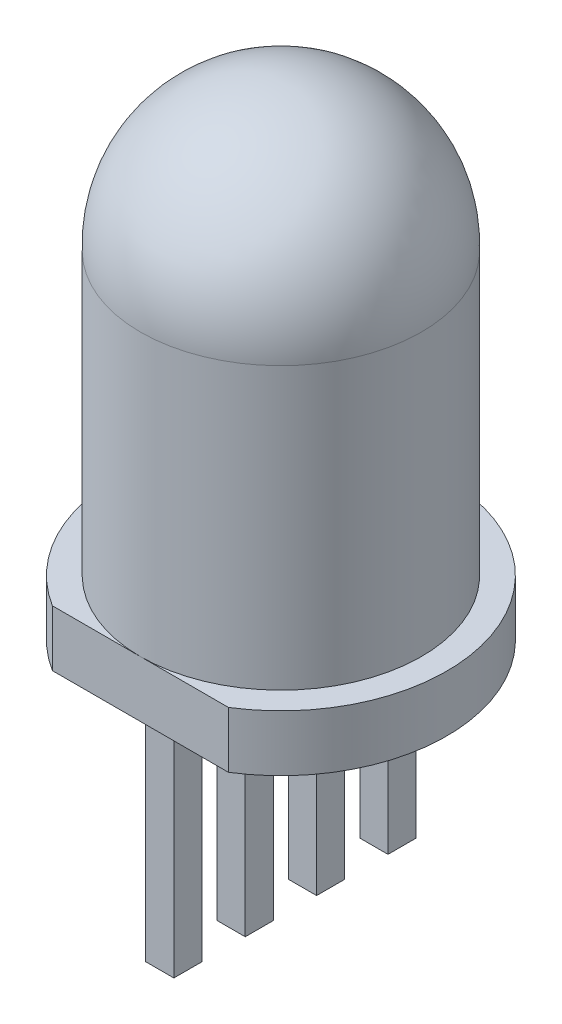
ISO-10303-21;
HEADER;
FILE_DESCRIPTION(('STEP AP214'),'2;1');
FILE_NAME('part.step','',(''),(''),'','','');
FILE_SCHEMA(('AUTOMOTIVE_DESIGN { 1 0 10303 214 1 1 1 1 }'));
ENDSEC;
DATA;
#1=APPLICATION_CONTEXT('core data for automotive mechanical design processes');
#2=APPLICATION_PROTOCOL_DEFINITION('international standard','automotive_design',2000,#1);
#3=PRODUCT_CONTEXT('',#1,'mechanical');
#4=PRODUCT('Part','Part','',(#3));
#5=PRODUCT_RELATED_PRODUCT_CATEGORY('part','',(#4));
#6=PRODUCT_DEFINITION_FORMATION('','',#4);
#7=PRODUCT_DEFINITION_CONTEXT('part definition',#1,'design');
#8=PRODUCT_DEFINITION('design','',#6,#7);
#9=PRODUCT_DEFINITION_SHAPE('','',#8);
#10=(LENGTH_UNIT() NAMED_UNIT(*) SI_UNIT(.MILLI.,.METRE.));
#11=(NAMED_UNIT(*) PLANE_ANGLE_UNIT() SI_UNIT($,.RADIAN.));
#12=(NAMED_UNIT(*) SI_UNIT($,.STERADIAN.) SOLID_ANGLE_UNIT());
#13=UNCERTAINTY_MEASURE_WITH_UNIT(LENGTH_MEASURE(1.E-05),#10,'distance_accuracy_value','');
#14=(GEOMETRIC_REPRESENTATION_CONTEXT(3) GLOBAL_UNCERTAINTY_ASSIGNED_CONTEXT((#13)) GLOBAL_UNIT_ASSIGNED_CONTEXT((#10,
#11,#12)) REPRESENTATION_CONTEXT('',''));
#15=CARTESIAN_POINT('',(0.,0.,0.));
#16=DIRECTION('',(0.,0.,1.));
#17=DIRECTION('',(1.,0.,0.));
#18=AXIS2_PLACEMENT_3D('',#15,#16,#17);
#19=CARTESIAN_POINT('',(0.,0.,0.));
#20=DIRECTION('',(0.,1.,0.));
#21=DIRECTION('',(0.,0.,1.));
#22=AXIS2_PLACEMENT_3D('',#19,#20,#21);
#23=PLANE('',#22);
#24=DIRECTION('',(0.,0.,1.));
#25=VECTOR('',#24,1.);
#26=CARTESIAN_POINT('',(0.25,0.,-0.385));
#27=LINE('',#26,#25);
#28=CARTESIAN_POINT('',(0.25,0.,-0.885));
#29=VERTEX_POINT('',#28);
#30=CARTESIAN_POINT('',(0.25,0.,-0.385));
#31=VERTEX_POINT('',#30);
#32=EDGE_CURVE('E182',#29,#31,#27,.T.);
#33=ORIENTED_EDGE('',*,*,#32,.F.);
#34=DIRECTION('',(1.,0.,0.));
#35=VECTOR('',#34,1.);
#36=CARTESIAN_POINT('',(0.25,0.,-0.885));
#37=LINE('',#36,#35);
#38=CARTESIAN_POINT('',(-0.25,0.,-0.885));
#39=VERTEX_POINT('',#38);
#40=EDGE_CURVE('E195',#39,#29,#37,.T.);
#41=ORIENTED_EDGE('',*,*,#40,.F.);
#42=DIRECTION('',(0.,0.,-1.));
#43=VECTOR('',#42,1.);
#44=CARTESIAN_POINT('',(-0.25,0.,-0.385));
#45=LINE('',#44,#43);
#46=CARTESIAN_POINT('',(-0.25,0.,-0.385));
#47=VERTEX_POINT('',#46);
#48=EDGE_CURVE('E204',#47,#39,#45,.T.);
#49=ORIENTED_EDGE('',*,*,#48,.F.);
#50=DIRECTION('',(-1.,0.,0.));
#51=VECTOR('',#50,1.);
#52=CARTESIAN_POINT('',(0.25,0.,-0.385));
#53=LINE('',#52,#51);
#54=EDGE_CURVE('E185',#31,#47,#53,.T.);
#55=ORIENTED_EDGE('',*,*,#54,.F.);
#56=EDGE_LOOP('',(#33,#41,#49,#55));
#57=FACE_BOUND('',#56,.T.);
#58=DIRECTION('',(0.,0.,1.));
#59=VECTOR('',#58,1.);
#60=CARTESIAN_POINT('',(0.25,0.,2.155));
#61=LINE('',#60,#59);
#62=CARTESIAN_POINT('',(0.25,0.,1.655));
#63=VERTEX_POINT('',#62);
#64=CARTESIAN_POINT('',(0.25,0.,2.155));
#65=VERTEX_POINT('',#64);
#66=EDGE_CURVE('E253',#63,#65,#61,.T.);
#67=ORIENTED_EDGE('',*,*,#66,.F.);
#68=DIRECTION('',(1.,0.,0.));
#69=VECTOR('',#68,1.);
#70=CARTESIAN_POINT('',(0.25,0.,1.655));
#71=LINE('',#70,#69);
#72=CARTESIAN_POINT('',(-0.25,0.,1.655));
#73=VERTEX_POINT('',#72);
#74=EDGE_CURVE('E258',#73,#63,#71,.T.);
#75=ORIENTED_EDGE('',*,*,#74,.F.);
#76=DIRECTION('',(0.,0.,-1.));
#77=VECTOR('',#76,1.);
#78=CARTESIAN_POINT('',(-0.25,0.,2.155));
#79=LINE('',#78,#77);
#80=CARTESIAN_POINT('',(-0.25,0.,2.155));
#81=VERTEX_POINT('',#80);
#82=EDGE_CURVE('E270',#81,#73,#79,.T.);
#83=ORIENTED_EDGE('',*,*,#82,.F.);
#84=DIRECTION('',(-1.,0.,0.));
#85=VECTOR('',#84,1.);
#86=CARTESIAN_POINT('',(0.25,0.,2.155));
#87=LINE('',#86,#85);
#88=EDGE_CURVE('E267',#65,#81,#87,.T.);
#89=ORIENTED_EDGE('',*,*,#88,.F.);
#90=EDGE_LOOP('',(#67,#75,#83,#89));
#91=FACE_BOUND('',#90,.T.);
#92=CARTESIAN_POINT('',(0.,0.,0.));
#93=DIRECTION('',(0.,1.,0.));
#94=DIRECTION('',(0.,0.,1.));
#95=AXIS2_PLACEMENT_3D('',#92,#93,#94);
#96=CIRCLE('',#95,2.95);
#97=CARTESIAN_POINT('',(1.56604597633659,0.,2.5));
#98=VERTEX_POINT('',#97);
#99=CARTESIAN_POINT('',(-1.56604597633659,0.,2.5));
#100=VERTEX_POINT('',#99);
#101=EDGE_CURVE('E296',#98,#100,#96,.T.);
#102=ORIENTED_EDGE('',*,*,#101,.F.);
#103=DIRECTION('',(1.,0.,0.));
#104=VECTOR('',#103,1.);
#105=CARTESIAN_POINT('',(-2.16489651360648,0.,2.5));
#106=LINE('',#105,#104);
#107=EDGE_CURVE('E290',#100,#98,#106,.T.);
#108=ORIENTED_EDGE('',*,*,#107,.F.);
#109=EDGE_LOOP('',(#102,#108));
#110=FACE_BOUND('',#109,.T.);
#111=DIRECTION('',(0.,0.,1.));
#112=VECTOR('',#111,1.);
#113=CARTESIAN_POINT('',(0.25,0.,0.885));
#114=LINE('',#113,#112);
#115=CARTESIAN_POINT('',(0.25,0.,0.385));
#116=VERTEX_POINT('',#115);
#117=CARTESIAN_POINT('',(0.25,0.,0.885));
#118=VERTEX_POINT('',#117);
#119=EDGE_CURVE('E220',#116,#118,#114,.T.);
#120=ORIENTED_EDGE('',*,*,#119,.F.);
#121=DIRECTION('',(1.,0.,0.));
#122=VECTOR('',#121,1.);
#123=CARTESIAN_POINT('',(0.25,0.,0.385));
#124=LINE('',#123,#122);
#125=CARTESIAN_POINT('',(-0.25,0.,0.385));
#126=VERTEX_POINT('',#125);
#127=EDGE_CURVE('E225',#126,#116,#124,.T.);
#128=ORIENTED_EDGE('',*,*,#127,.F.);
#129=DIRECTION('',(0.,0.,-1.));
#130=VECTOR('',#129,1.);
#131=CARTESIAN_POINT('',(-0.25,0.,0.885));
#132=LINE('',#131,#130);
#133=CARTESIAN_POINT('',(-0.25,0.,0.885));
#134=VERTEX_POINT('',#133);
#135=EDGE_CURVE('E237',#134,#126,#132,.T.);
#136=ORIENTED_EDGE('',*,*,#135,.F.);
#137=DIRECTION('',(-1.,0.,0.));
#138=VECTOR('',#137,1.);
#139=CARTESIAN_POINT('',(0.25,0.,0.885));
#140=LINE('',#139,#138);
#141=EDGE_CURVE('E234',#118,#134,#140,.T.);
#142=ORIENTED_EDGE('',*,*,#141,.F.);
#143=EDGE_LOOP('',(#120,#128,#136,#142));
#144=FACE_BOUND('',#143,.T.);
#145=DIRECTION('',(0.,0.,1.));
#146=VECTOR('',#145,1.);
#147=CARTESIAN_POINT('',(0.25,0.,-1.655));
#148=LINE('',#147,#146);
#149=CARTESIAN_POINT('',(0.25,0.,-2.155));
#150=VERTEX_POINT('',#149);
#151=CARTESIAN_POINT('',(0.25,0.,-1.655));
#152=VERTEX_POINT('',#151);
#153=EDGE_CURVE('E181',#150,#152,#148,.T.);
#154=ORIENTED_EDGE('',*,*,#153,.F.);
#155=DIRECTION('',(1.,0.,0.));
#156=VECTOR('',#155,1.);
#157=CARTESIAN_POINT('',(0.25,0.,-2.155));
#158=LINE('',#157,#156);
#159=CARTESIAN_POINT('',(-0.25,0.,-2.155));
#160=VERTEX_POINT('',#159);
#161=EDGE_CURVE('E178',#160,#150,#158,.T.);
#162=ORIENTED_EDGE('',*,*,#161,.F.);
#163=DIRECTION('',(0.,0.,-1.));
#164=VECTOR('',#163,1.);
#165=CARTESIAN_POINT('',(-0.25,0.,-1.655));
#166=LINE('',#165,#164);
#167=CARTESIAN_POINT('',(-0.25,0.,-1.655));
#168=VERTEX_POINT('',#167);
#169=EDGE_CURVE('E53',#168,#160,#166,.T.);
#170=ORIENTED_EDGE('',*,*,#169,.F.);
#171=DIRECTION('',(-1.,0.,0.));
#172=VECTOR('',#171,1.);
#173=CARTESIAN_POINT('',(0.25,0.,-1.655));
#174=LINE('',#173,#172);
#175=EDGE_CURVE('E48',#152,#168,#174,.T.);
#176=ORIENTED_EDGE('',*,*,#175,.F.);
#177=EDGE_LOOP('',(#154,#162,#170,#176));
#178=FACE_BOUND('',#177,.T.);
#179=ADVANCED_FACE('F33',(#57,#91,#110,#144,#178),#23,.F.);
#180=CARTESIAN_POINT('',(0.,6.,0.));
#181=DIRECTION('',(0.,-1.,0.));
#182=DIRECTION('',(0.,0.,-1.));
#183=AXIS2_PLACEMENT_3D('',#180,#181,#182);
#184=CYLINDRICAL_SURFACE('',#183,2.5);
#185=CARTESIAN_POINT('',(0.,1.,0.));
#186=DIRECTION('',(0.,1.,0.));
#187=DIRECTION('',(0.,0.,1.));
#188=AXIS2_PLACEMENT_3D('',#185,#186,#187);
#189=CIRCLE('',#188,2.5);
#190=CARTESIAN_POINT('',(0.,1.,2.5));
#191=VERTEX_POINT('',#190);
#192=EDGE_CURVE('E41',#191,#191,#189,.T.);
#193=ORIENTED_EDGE('',*,*,#192,.T.);
#194=EDGE_LOOP('',(#193));
#195=FACE_BOUND('',#194,.T.);
#196=CARTESIAN_POINT('',(0.,6.,0.));
#197=DIRECTION('',(0.,1.,0.));
#198=DIRECTION('',(0.,0.,1.));
#199=AXIS2_PLACEMENT_3D('',#196,#197,#198);
#200=CIRCLE('',#199,2.5);
#201=CARTESIAN_POINT('',(0.,6.,2.5));
#202=VERTEX_POINT('',#201);
#203=EDGE_CURVE('E11',#202,#202,#200,.T.);
#204=ORIENTED_EDGE('',*,*,#203,.F.);
#205=EDGE_LOOP('',(#204));
#206=FACE_BOUND('',#205,.T.);
#207=ADVANCED_FACE('F304',(#195,#206),#184,.T.);
#208=CARTESIAN_POINT('',(0.,6.09807692307692,0.));
#209=DIRECTION('',(0.,0.,1.));
#210=DIRECTION('',(1.,0.,0.));
#211=AXIS2_PLACEMENT_3D('',#208,#209,#210);
#212=SPHERICAL_SURFACE('',#211,2.50192307692308);
#213=CARTESIAN_POINT('',(0.,6.09807692307692,0.));
#214=DIRECTION('',(0.,1.,0.));
#215=DIRECTION('',(0.,0.,1.));
#216=AXIS2_PLACEMENT_3D('',#213,#214,#215);
#217=SPHERICAL_SURFACE('',#216,2.50192307692308);
#218=ORIENTED_EDGE('',*,*,#203,.T.);
#219=EDGE_LOOP('',(#218));
#220=FACE_BOUND('',#219,.T.);
#221=ADVANCED_FACE('F35',(#220),#217,.T.);
#222=CARTESIAN_POINT('',(0.,1.,0.));
#223=DIRECTION('',(0.,1.,0.));
#224=DIRECTION('',(0.,0.,1.));
#225=AXIS2_PLACEMENT_3D('',#222,#223,#224);
#226=PLANE('',#225);
#227=DIRECTION('',(1.,0.,0.));
#228=VECTOR('',#227,1.);
#229=CARTESIAN_POINT('',(-2.16489651360648,1.,2.5));
#230=LINE('',#229,#228);
#231=CARTESIAN_POINT('',(1.56604597633659,1.,2.5));
#232=VERTEX_POINT('',#231);
#233=EDGE_CURVE('E292',#191,#232,#230,.T.);
#234=ORIENTED_EDGE('',*,*,#233,.T.);
#235=CARTESIAN_POINT('',(0.,1.,0.));
#236=DIRECTION('',(0.,1.,0.));
#237=DIRECTION('',(0.,0.,1.));
#238=AXIS2_PLACEMENT_3D('',#235,#236,#237);
#239=CIRCLE('',#238,2.95);
#240=CARTESIAN_POINT('',(-1.56604597633659,1.,2.5));
#241=VERTEX_POINT('',#240);
#242=EDGE_CURVE('E297',#232,#241,#239,.T.);
#243=ORIENTED_EDGE('',*,*,#242,.T.);
#244=EDGE_CURVE('E293',#241,#191,#230,.T.);
#245=ORIENTED_EDGE('',*,*,#244,.T.);
#246=ORIENTED_EDGE('',*,*,#192,.F.);
#247=EDGE_LOOP('',(#234,#243,#245,#246));
#248=FACE_BOUND('',#247,.T.);
#249=ADVANCED_FACE('F308',(#248),#226,.T.);
#250=CARTESIAN_POINT('',(0.,1.,0.));
#251=DIRECTION('',(0.,-1.,0.));
#252=DIRECTION('',(0.,0.,-1.));
#253=AXIS2_PLACEMENT_3D('',#250,#251,#252);
#254=CYLINDRICAL_SURFACE('',#253,2.95);
#255=ORIENTED_EDGE('',*,*,#242,.F.);
#256=DIRECTION('',(0.,-1.,0.));
#257=VECTOR('',#256,1.);
#258=CARTESIAN_POINT('',(1.56604597633659,1.,2.5));
#259=LINE('',#258,#257);
#260=EDGE_CURVE('E288',#98,#232,#259,.F.);
#261=ORIENTED_EDGE('',*,*,#260,.F.);
#262=ORIENTED_EDGE('',*,*,#101,.T.);
#263=DIRECTION('',(0.,-1.,0.));
#264=VECTOR('',#263,1.);
#265=CARTESIAN_POINT('',(-1.56604597633659,1.,2.5));
#266=LINE('',#265,#264);
#267=EDGE_CURVE('E286',#241,#100,#266,.T.);
#268=ORIENTED_EDGE('',*,*,#267,.F.);
#269=EDGE_LOOP('',(#255,#261,#262,#268));
#270=FACE_BOUND('',#269,.T.);
#271=ADVANCED_FACE('F315',(#270),#254,.T.);
#272=CARTESIAN_POINT('',(-2.16489651360648,8.601,2.5));
#273=DIRECTION('',(0.,0.,-1.));
#274=DIRECTION('',(-1.,0.,0.));
#275=AXIS2_PLACEMENT_3D('',#272,#273,#274);
#276=PLANE('',#275);
#277=ORIENTED_EDGE('',*,*,#244,.F.);
#278=ORIENTED_EDGE('',*,*,#267,.T.);
#279=ORIENTED_EDGE('',*,*,#107,.T.);
#280=ORIENTED_EDGE('',*,*,#260,.T.);
#281=ORIENTED_EDGE('',*,*,#233,.F.);
#282=EDGE_LOOP('',(#277,#278,#279,#280,#281));
#283=FACE_BOUND('',#282,.T.);
#284=ADVANCED_FACE('F312',(#283),#276,.F.);
#285=CARTESIAN_POINT('',(0.25,-4.,2.155));
#286=DIRECTION('',(-1.,0.,0.));
#287=DIRECTION('',(0.,0.,1.));
#288=AXIS2_PLACEMENT_3D('',#285,#286,#287);
#289=PLANE('',#288);
#290=ORIENTED_EDGE('',*,*,#66,.T.);
#291=DIRECTION('',(0.,1.,0.));
#292=VECTOR('',#291,1.);
#293=CARTESIAN_POINT('',(0.25,-4.,2.155));
#294=LINE('',#293,#292);
#295=CARTESIAN_POINT('',(0.25,-4.,2.155));
#296=VERTEX_POINT('',#295);
#297=EDGE_CURVE('E283',#296,#65,#294,.T.);
#298=ORIENTED_EDGE('',*,*,#297,.F.);
#299=DIRECTION('',(0.,0.,1.));
#300=VECTOR('',#299,1.);
#301=CARTESIAN_POINT('',(0.25,-4.,2.155));
#302=LINE('',#301,#300);
#303=CARTESIAN_POINT('',(0.25,-4.,1.655));
#304=VERTEX_POINT('',#303);
#305=EDGE_CURVE('E254',#304,#296,#302,.T.);
#306=ORIENTED_EDGE('',*,*,#305,.F.);
#307=DIRECTION('',(0.,1.,0.));
#308=VECTOR('',#307,1.);
#309=CARTESIAN_POINT('',(0.25,-4.,1.655));
#310=LINE('',#309,#308);
#311=EDGE_CURVE('E264',#304,#63,#310,.T.);
#312=ORIENTED_EDGE('',*,*,#311,.T.);
#313=EDGE_LOOP('',(#290,#298,#306,#312));
#314=FACE_BOUND('',#313,.T.);
#315=ADVANCED_FACE('F405',(#314),#289,.F.);
#316=CARTESIAN_POINT('',(0.25,-4.,2.155));
#317=DIRECTION('',(0.,0.,-1.));
#318=DIRECTION('',(-1.,0.,0.));
#319=AXIS2_PLACEMENT_3D('',#316,#317,#318);
#320=PLANE('',#319);
#321=ORIENTED_EDGE('',*,*,#88,.T.);
#322=DIRECTION('',(0.,1.,0.));
#323=VECTOR('',#322,1.);
#324=CARTESIAN_POINT('',(-0.25,-4.,2.155));
#325=LINE('',#324,#323);
#326=CARTESIAN_POINT('',(-0.25,-4.,2.155));
#327=VERTEX_POINT('',#326);
#328=EDGE_CURVE('E280',#327,#81,#325,.T.);
#329=ORIENTED_EDGE('',*,*,#328,.F.);
#330=DIRECTION('',(-1.,0.,0.));
#331=VECTOR('',#330,1.);
#332=CARTESIAN_POINT('',(0.25,-4.,2.155));
#333=LINE('',#332,#331);
#334=EDGE_CURVE('E257',#296,#327,#333,.T.);
#335=ORIENTED_EDGE('',*,*,#334,.F.);
#336=ORIENTED_EDGE('',*,*,#297,.T.);
#337=EDGE_LOOP('',(#321,#329,#335,#336));
#338=FACE_BOUND('',#337,.T.);
#339=ADVANCED_FACE('F401',(#338),#320,.F.);
#340=CARTESIAN_POINT('',(-0.25,-4.,2.155));
#341=DIRECTION('',(1.,0.,0.));
#342=DIRECTION('',(0.,0.,-1.));
#343=AXIS2_PLACEMENT_3D('',#340,#341,#342);
#344=PLANE('',#343);
#345=ORIENTED_EDGE('',*,*,#82,.T.);
#346=DIRECTION('',(0.,1.,0.));
#347=VECTOR('',#346,1.);
#348=CARTESIAN_POINT('',(-0.25,-4.,1.655));
#349=LINE('',#348,#347);
#350=CARTESIAN_POINT('',(-0.25,-4.,1.655));
#351=VERTEX_POINT('',#350);
#352=EDGE_CURVE('E277',#351,#73,#349,.T.);
#353=ORIENTED_EDGE('',*,*,#352,.F.);
#354=DIRECTION('',(0.,0.,-1.));
#355=VECTOR('',#354,1.);
#356=CARTESIAN_POINT('',(-0.25,-4.,2.155));
#357=LINE('',#356,#355);
#358=EDGE_CURVE('E260',#327,#351,#357,.T.);
#359=ORIENTED_EDGE('',*,*,#358,.F.);
#360=ORIENTED_EDGE('',*,*,#328,.T.);
#361=EDGE_LOOP('',(#345,#353,#359,#360));
#362=FACE_BOUND('',#361,.T.);
#363=ADVANCED_FACE('F397',(#362),#344,.F.);
#364=CARTESIAN_POINT('',(0.25,-4.,1.655));
#365=DIRECTION('',(0.,0.,1.));
#366=DIRECTION('',(1.,0.,0.));
#367=AXIS2_PLACEMENT_3D('',#364,#365,#366);
#368=PLANE('',#367);
#369=ORIENTED_EDGE('',*,*,#74,.T.);
#370=ORIENTED_EDGE('',*,*,#311,.F.);
#371=DIRECTION('',(1.,0.,0.));
#372=VECTOR('',#371,1.);
#373=CARTESIAN_POINT('',(0.25,-4.,1.655));
#374=LINE('',#373,#372);
#375=EDGE_CURVE('E262',#351,#304,#374,.T.);
#376=ORIENTED_EDGE('',*,*,#375,.F.);
#377=ORIENTED_EDGE('',*,*,#352,.T.);
#378=EDGE_LOOP('',(#369,#370,#376,#377));
#379=FACE_BOUND('',#378,.T.);
#380=ADVANCED_FACE('F393',(#379),#368,.F.);
#381=CARTESIAN_POINT('',(0.,-4.,0.));
#382=DIRECTION('',(0.,1.,0.));
#383=DIRECTION('',(0.,0.,1.));
#384=AXIS2_PLACEMENT_3D('',#381,#382,#383);
#385=PLANE('',#384);
#386=ORIENTED_EDGE('',*,*,#305,.T.);
#387=ORIENTED_EDGE('',*,*,#334,.T.);
#388=ORIENTED_EDGE('',*,*,#358,.T.);
#389=ORIENTED_EDGE('',*,*,#375,.T.);
#390=EDGE_LOOP('',(#386,#387,#388,#389));
#391=FACE_BOUND('',#390,.T.);
#392=ADVANCED_FACE('F389',(#391),#385,.F.);
#393=CARTESIAN_POINT('',(0.25,-4.,0.885));
#394=DIRECTION('',(-1.,0.,0.));
#395=DIRECTION('',(0.,0.,1.));
#396=AXIS2_PLACEMENT_3D('',#393,#394,#395);
#397=PLANE('',#396);
#398=ORIENTED_EDGE('',*,*,#119,.T.);
#399=DIRECTION('',(0.,1.,0.));
#400=VECTOR('',#399,1.);
#401=CARTESIAN_POINT('',(0.25,-4.,0.885));
#402=LINE('',#401,#400);
#403=CARTESIAN_POINT('',(0.25,-4.,0.885));
#404=VERTEX_POINT('',#403);
#405=EDGE_CURVE('E250',#404,#118,#402,.T.);
#406=ORIENTED_EDGE('',*,*,#405,.F.);
#407=DIRECTION('',(0.,0.,1.));
#408=VECTOR('',#407,1.);
#409=CARTESIAN_POINT('',(0.25,-4.,0.885));
#410=LINE('',#409,#408);
#411=CARTESIAN_POINT('',(0.25,-4.,0.385));
#412=VERTEX_POINT('',#411);
#413=EDGE_CURVE('E221',#412,#404,#410,.T.);
#414=ORIENTED_EDGE('',*,*,#413,.F.);
#415=DIRECTION('',(0.,1.,0.));
#416=VECTOR('',#415,1.);
#417=CARTESIAN_POINT('',(0.25,-4.,0.385));
#418=LINE('',#417,#416);
#419=EDGE_CURVE('E231',#412,#116,#418,.T.);
#420=ORIENTED_EDGE('',*,*,#419,.T.);
#421=EDGE_LOOP('',(#398,#406,#414,#420));
#422=FACE_BOUND('',#421,.T.);
#423=ADVANCED_FACE('F385',(#422),#397,.F.);
#424=CARTESIAN_POINT('',(0.25,-4.,0.885));
#425=DIRECTION('',(0.,0.,-1.));
#426=DIRECTION('',(-1.,0.,0.));
#427=AXIS2_PLACEMENT_3D('',#424,#425,#426);
#428=PLANE('',#427);
#429=ORIENTED_EDGE('',*,*,#141,.T.);
#430=DIRECTION('',(0.,1.,0.));
#431=VECTOR('',#430,1.);
#432=CARTESIAN_POINT('',(-0.25,-4.,0.885));
#433=LINE('',#432,#431);
#434=CARTESIAN_POINT('',(-0.25,-4.,0.885));
#435=VERTEX_POINT('',#434);
#436=EDGE_CURVE('E247',#435,#134,#433,.T.);
#437=ORIENTED_EDGE('',*,*,#436,.F.);
#438=DIRECTION('',(-1.,0.,0.));
#439=VECTOR('',#438,1.);
#440=CARTESIAN_POINT('',(0.25,-4.,0.885));
#441=LINE('',#440,#439);
#442=EDGE_CURVE('E224',#404,#435,#441,.T.);
#443=ORIENTED_EDGE('',*,*,#442,.F.);
#444=ORIENTED_EDGE('',*,*,#405,.T.);
#445=EDGE_LOOP('',(#429,#437,#443,#444));
#446=FACE_BOUND('',#445,.T.);
#447=ADVANCED_FACE('F381',(#446),#428,.F.);
#448=CARTESIAN_POINT('',(-0.25,-4.,0.885));
#449=DIRECTION('',(1.,0.,0.));
#450=DIRECTION('',(0.,0.,-1.));
#451=AXIS2_PLACEMENT_3D('',#448,#449,#450);
#452=PLANE('',#451);
#453=ORIENTED_EDGE('',*,*,#135,.T.);
#454=DIRECTION('',(0.,1.,0.));
#455=VECTOR('',#454,1.);
#456=CARTESIAN_POINT('',(-0.25,-4.,0.385));
#457=LINE('',#456,#455);
#458=CARTESIAN_POINT('',(-0.25,-4.,0.385));
#459=VERTEX_POINT('',#458);
#460=EDGE_CURVE('E244',#459,#126,#457,.T.);
#461=ORIENTED_EDGE('',*,*,#460,.F.);
#462=DIRECTION('',(0.,0.,-1.));
#463=VECTOR('',#462,1.);
#464=CARTESIAN_POINT('',(-0.25,-4.,0.885));
#465=LINE('',#464,#463);
#466=EDGE_CURVE('E227',#435,#459,#465,.T.);
#467=ORIENTED_EDGE('',*,*,#466,.F.);
#468=ORIENTED_EDGE('',*,*,#436,.T.);
#469=EDGE_LOOP('',(#453,#461,#467,#468));
#470=FACE_BOUND('',#469,.T.);
#471=ADVANCED_FACE('F377',(#470),#452,.F.);
#472=CARTESIAN_POINT('',(0.25,-4.,0.385));
#473=DIRECTION('',(0.,0.,1.));
#474=DIRECTION('',(1.,0.,0.));
#475=AXIS2_PLACEMENT_3D('',#472,#473,#474);
#476=PLANE('',#475);
#477=ORIENTED_EDGE('',*,*,#127,.T.);
#478=ORIENTED_EDGE('',*,*,#419,.F.);
#479=DIRECTION('',(1.,0.,0.));
#480=VECTOR('',#479,1.);
#481=CARTESIAN_POINT('',(0.25,-4.,0.385));
#482=LINE('',#481,#480);
#483=EDGE_CURVE('E229',#459,#412,#482,.T.);
#484=ORIENTED_EDGE('',*,*,#483,.F.);
#485=ORIENTED_EDGE('',*,*,#460,.T.);
#486=EDGE_LOOP('',(#477,#478,#484,#485));
#487=FACE_BOUND('',#486,.T.);
#488=ADVANCED_FACE('F373',(#487),#476,.F.);
#489=CARTESIAN_POINT('',(0.,-4.,0.));
#490=DIRECTION('',(0.,1.,0.));
#491=DIRECTION('',(0.,0.,1.));
#492=AXIS2_PLACEMENT_3D('',#489,#490,#491);
#493=PLANE('',#492);
#494=ORIENTED_EDGE('',*,*,#413,.T.);
#495=ORIENTED_EDGE('',*,*,#442,.T.);
#496=ORIENTED_EDGE('',*,*,#466,.T.);
#497=ORIENTED_EDGE('',*,*,#483,.T.);
#498=EDGE_LOOP('',(#494,#495,#496,#497));
#499=FACE_BOUND('',#498,.T.);
#500=ADVANCED_FACE('F369',(#499),#493,.F.);
#501=CARTESIAN_POINT('',(0.25,-4.,-0.385));
#502=DIRECTION('',(-1.,0.,0.));
#503=DIRECTION('',(0.,0.,1.));
#504=AXIS2_PLACEMENT_3D('',#501,#502,#503);
#505=PLANE('',#504);
#506=ORIENTED_EDGE('',*,*,#32,.T.);
#507=DIRECTION('',(0.,1.,0.));
#508=VECTOR('',#507,1.);
#509=CARTESIAN_POINT('',(0.25,-4.,-0.385));
#510=LINE('',#509,#508);
#511=CARTESIAN_POINT('',(0.25,-4.,-0.385));
#512=VERTEX_POINT('',#511);
#513=EDGE_CURVE('E217',#512,#31,#510,.T.);
#514=ORIENTED_EDGE('',*,*,#513,.F.);
#515=DIRECTION('',(0.,0.,1.));
#516=VECTOR('',#515,1.);
#517=CARTESIAN_POINT('',(0.25,-4.,-0.385));
#518=LINE('',#517,#516);
#519=CARTESIAN_POINT('',(0.25,-4.,-0.885));
#520=VERTEX_POINT('',#519);
#521=EDGE_CURVE('E191',#520,#512,#518,.T.);
#522=ORIENTED_EDGE('',*,*,#521,.F.);
#523=DIRECTION('',(0.,1.,0.));
#524=VECTOR('',#523,1.);
#525=CARTESIAN_POINT('',(0.25,-4.,-0.885));
#526=LINE('',#525,#524);
#527=EDGE_CURVE('E200',#520,#29,#526,.T.);
#528=ORIENTED_EDGE('',*,*,#527,.T.);
#529=EDGE_LOOP('',(#506,#514,#522,#528));
#530=FACE_BOUND('',#529,.T.);
#531=ADVANCED_FACE('F365',(#530),#505,.F.);
#532=CARTESIAN_POINT('',(0.25,-4.,-0.385));
#533=DIRECTION('',(0.,0.,-1.));
#534=DIRECTION('',(-1.,0.,0.));
#535=AXIS2_PLACEMENT_3D('',#532,#533,#534);
#536=PLANE('',#535);
#537=ORIENTED_EDGE('',*,*,#54,.T.);
#538=DIRECTION('',(0.,1.,0.));
#539=VECTOR('',#538,1.);
#540=CARTESIAN_POINT('',(-0.25,-4.,-0.385));
#541=LINE('',#540,#539);
#542=CARTESIAN_POINT('',(-0.25,-4.,-0.385));
#543=VERTEX_POINT('',#542);
#544=EDGE_CURVE('E214',#543,#47,#541,.T.);
#545=ORIENTED_EDGE('',*,*,#544,.F.);
#546=DIRECTION('',(-1.,0.,0.));
#547=VECTOR('',#546,1.);
#548=CARTESIAN_POINT('',(0.25,-4.,-0.385));
#549=LINE('',#548,#547);
#550=EDGE_CURVE('E194',#512,#543,#549,.T.);
#551=ORIENTED_EDGE('',*,*,#550,.F.);
#552=ORIENTED_EDGE('',*,*,#513,.T.);
#553=EDGE_LOOP('',(#537,#545,#551,#552));
#554=FACE_BOUND('',#553,.T.);
#555=ADVANCED_FACE('F361',(#554),#536,.F.);
#556=CARTESIAN_POINT('',(-0.25,-4.,-0.385));
#557=DIRECTION('',(1.,0.,0.));
#558=DIRECTION('',(0.,0.,-1.));
#559=AXIS2_PLACEMENT_3D('',#556,#557,#558);
#560=PLANE('',#559);
#561=ORIENTED_EDGE('',*,*,#48,.T.);
#562=DIRECTION('',(0.,1.,0.));
#563=VECTOR('',#562,1.);
#564=CARTESIAN_POINT('',(-0.25,-4.,-0.885));
#565=LINE('',#564,#563);
#566=CARTESIAN_POINT('',(-0.25,-4.,-0.885));
#567=VERTEX_POINT('',#566);
#568=EDGE_CURVE('E211',#567,#39,#565,.T.);
#569=ORIENTED_EDGE('',*,*,#568,.F.);
#570=DIRECTION('',(0.,0.,-1.));
#571=VECTOR('',#570,1.);
#572=CARTESIAN_POINT('',(-0.25,-4.,-0.385));
#573=LINE('',#572,#571);
#574=EDGE_CURVE('E197',#543,#567,#573,.T.);
#575=ORIENTED_EDGE('',*,*,#574,.F.);
#576=ORIENTED_EDGE('',*,*,#544,.T.);
#577=EDGE_LOOP('',(#561,#569,#575,#576));
#578=FACE_BOUND('',#577,.T.);
#579=ADVANCED_FACE('F357',(#578),#560,.F.);
#580=CARTESIAN_POINT('',(0.25,-4.,-0.885));
#581=DIRECTION('',(0.,0.,1.));
#582=DIRECTION('',(1.,0.,0.));
#583=AXIS2_PLACEMENT_3D('',#580,#581,#582);
#584=PLANE('',#583);
#585=ORIENTED_EDGE('',*,*,#40,.T.);
#586=ORIENTED_EDGE('',*,*,#527,.F.);
#587=DIRECTION('',(1.,0.,0.));
#588=VECTOR('',#587,1.);
#589=CARTESIAN_POINT('',(0.25,-4.,-0.885));
#590=LINE('',#589,#588);
#591=EDGE_CURVE('E199',#567,#520,#590,.T.);
#592=ORIENTED_EDGE('',*,*,#591,.F.);
#593=ORIENTED_EDGE('',*,*,#568,.T.);
#594=EDGE_LOOP('',(#585,#586,#592,#593));
#595=FACE_BOUND('',#594,.T.);
#596=ADVANCED_FACE('F353',(#595),#584,.F.);
#597=CARTESIAN_POINT('',(0.,-4.,0.));
#598=DIRECTION('',(0.,1.,0.));
#599=DIRECTION('',(0.,0.,1.));
#600=AXIS2_PLACEMENT_3D('',#597,#598,#599);
#601=PLANE('',#600);
#602=ORIENTED_EDGE('',*,*,#521,.T.);
#603=ORIENTED_EDGE('',*,*,#550,.T.);
#604=ORIENTED_EDGE('',*,*,#574,.T.);
#605=ORIENTED_EDGE('',*,*,#591,.T.);
#606=EDGE_LOOP('',(#602,#603,#604,#605));
#607=FACE_BOUND('',#606,.T.);
#608=ADVANCED_FACE('F350',(#607),#601,.F.);
#609=CARTESIAN_POINT('',(0.25,-4.,-1.655));
#610=DIRECTION('',(-1.,0.,0.));
#611=DIRECTION('',(0.,0.,1.));
#612=AXIS2_PLACEMENT_3D('',#609,#610,#611);
#613=PLANE('',#612);
#614=ORIENTED_EDGE('',*,*,#153,.T.);
#615=DIRECTION('',(0.,1.,0.));
#616=VECTOR('',#615,1.);
#617=CARTESIAN_POINT('',(0.25,-4.,-1.655));
#618=LINE('',#617,#616);
#619=CARTESIAN_POINT('',(0.25,-4.,-1.655));
#620=VERTEX_POINT('',#619);
#621=EDGE_CURVE('E162',#620,#152,#618,.T.);
#622=ORIENTED_EDGE('',*,*,#621,.F.);
#623=DIRECTION('',(0.,0.,1.));
#624=VECTOR('',#623,1.);
#625=CARTESIAN_POINT('',(0.25,-4.,-1.655));
#626=LINE('',#625,#624);
#627=CARTESIAN_POINT('',(0.25,-4.,-2.155));
#628=VERTEX_POINT('',#627);
#629=EDGE_CURVE('E169',#628,#620,#626,.T.);
#630=ORIENTED_EDGE('',*,*,#629,.F.);
#631=DIRECTION('',(0.,1.,0.));
#632=VECTOR('',#631,1.);
#633=CARTESIAN_POINT('',(0.25,-4.,-2.155));
#634=LINE('',#633,#632);
#635=EDGE_CURVE('E328',#628,#150,#634,.T.);
#636=ORIENTED_EDGE('',*,*,#635,.T.);
#637=EDGE_LOOP('',(#614,#622,#630,#636));
#638=FACE_BOUND('',#637,.T.);
#639=ADVANCED_FACE('F180',(#638),#613,.F.);
#640=CARTESIAN_POINT('',(0.25,-4.,-1.655));
#641=DIRECTION('',(0.,0.,-1.));
#642=DIRECTION('',(-1.,0.,0.));
#643=AXIS2_PLACEMENT_3D('',#640,#641,#642);
#644=PLANE('',#643);
#645=ORIENTED_EDGE('',*,*,#175,.T.);
#646=DIRECTION('',(0.,1.,0.));
#647=VECTOR('',#646,1.);
#648=CARTESIAN_POINT('',(-0.25,-4.,-1.655));
#649=LINE('',#648,#647);
#650=CARTESIAN_POINT('',(-0.25,-4.,-1.655));
#651=VERTEX_POINT('',#650);
#652=EDGE_CURVE('E165',#651,#168,#649,.T.);
#653=ORIENTED_EDGE('',*,*,#652,.F.);
#654=DIRECTION('',(-1.,0.,0.));
#655=VECTOR('',#654,1.);
#656=CARTESIAN_POINT('',(0.25,-4.,-1.655));
#657=LINE('',#656,#655);
#658=EDGE_CURVE('E158',#620,#651,#657,.T.);
#659=ORIENTED_EDGE('',*,*,#658,.F.);
#660=ORIENTED_EDGE('',*,*,#621,.T.);
#661=EDGE_LOOP('',(#645,#653,#659,#660));
#662=FACE_BOUND('',#661,.T.);
#663=ADVANCED_FACE('F160',(#662),#644,.F.);
#664=CARTESIAN_POINT('',(-0.25,-4.,-1.655));
#665=DIRECTION('',(1.,0.,0.));
#666=DIRECTION('',(0.,0.,-1.));
#667=AXIS2_PLACEMENT_3D('',#664,#665,#666);
#668=PLANE('',#667);
#669=ORIENTED_EDGE('',*,*,#169,.T.);
#670=DIRECTION('',(0.,1.,0.));
#671=VECTOR('',#670,1.);
#672=CARTESIAN_POINT('',(-0.25,-4.,-2.155));
#673=LINE('',#672,#671);
#674=CARTESIAN_POINT('',(-0.25,-4.,-2.155));
#675=VERTEX_POINT('',#674);
#676=EDGE_CURVE('E187',#675,#160,#673,.T.);
#677=ORIENTED_EDGE('',*,*,#676,.F.);
#678=DIRECTION('',(0.,0.,-1.));
#679=VECTOR('',#678,1.);
#680=CARTESIAN_POINT('',(-0.25,-4.,-1.655));
#681=LINE('',#680,#679);
#682=EDGE_CURVE('E168',#651,#675,#681,.T.);
#683=ORIENTED_EDGE('',*,*,#682,.F.);
#684=ORIENTED_EDGE('',*,*,#652,.T.);
#685=EDGE_LOOP('',(#669,#677,#683,#684));
#686=FACE_BOUND('',#685,.T.);
#687=ADVANCED_FACE('F337',(#686),#668,.F.);
#688=CARTESIAN_POINT('',(0.25,-4.,-2.155));
#689=DIRECTION('',(0.,0.,1.));
#690=DIRECTION('',(1.,0.,0.));
#691=AXIS2_PLACEMENT_3D('',#688,#689,#690);
#692=PLANE('',#691);
#693=ORIENTED_EDGE('',*,*,#161,.T.);
#694=ORIENTED_EDGE('',*,*,#635,.F.);
#695=DIRECTION('',(1.,0.,0.));
#696=VECTOR('',#695,1.);
#697=CARTESIAN_POINT('',(0.25,-4.,-2.155));
#698=LINE('',#697,#696);
#699=EDGE_CURVE('E174',#675,#628,#698,.T.);
#700=ORIENTED_EDGE('',*,*,#699,.F.);
#701=ORIENTED_EDGE('',*,*,#676,.T.);
#702=EDGE_LOOP('',(#693,#694,#700,#701));
#703=FACE_BOUND('',#702,.T.);
#704=ADVANCED_FACE('F327',(#703),#692,.F.);
#705=CARTESIAN_POINT('',(0.,-4.,0.));
#706=DIRECTION('',(0.,1.,0.));
#707=DIRECTION('',(0.,0.,1.));
#708=AXIS2_PLACEMENT_3D('',#705,#706,#707);
#709=PLANE('',#708);
#710=ORIENTED_EDGE('',*,*,#629,.T.);
#711=ORIENTED_EDGE('',*,*,#658,.T.);
#712=ORIENTED_EDGE('',*,*,#682,.T.);
#713=ORIENTED_EDGE('',*,*,#699,.T.);
#714=EDGE_LOOP('',(#710,#711,#712,#713));
#715=FACE_BOUND('',#714,.T.);
#716=ADVANCED_FACE('F172',(#715),#709,.F.);
#717=CLOSED_SHELL('',(#179,#207,#221,#249,#271,#284,#315,#339,#363,#380,#392,#423,#447,#471,
#488,#500,#531,#555,#579,#596,#608,#639,#663,#687,#704,#716));
#718=MANIFOLD_SOLID_BREP('B2',#717);
#719=ADVANCED_BREP_SHAPE_REPRESENTATION('',(#18,#718),#14);
#720=SHAPE_DEFINITION_REPRESENTATION(#9,#719);
ENDSEC;
END-ISO-10303-21;
